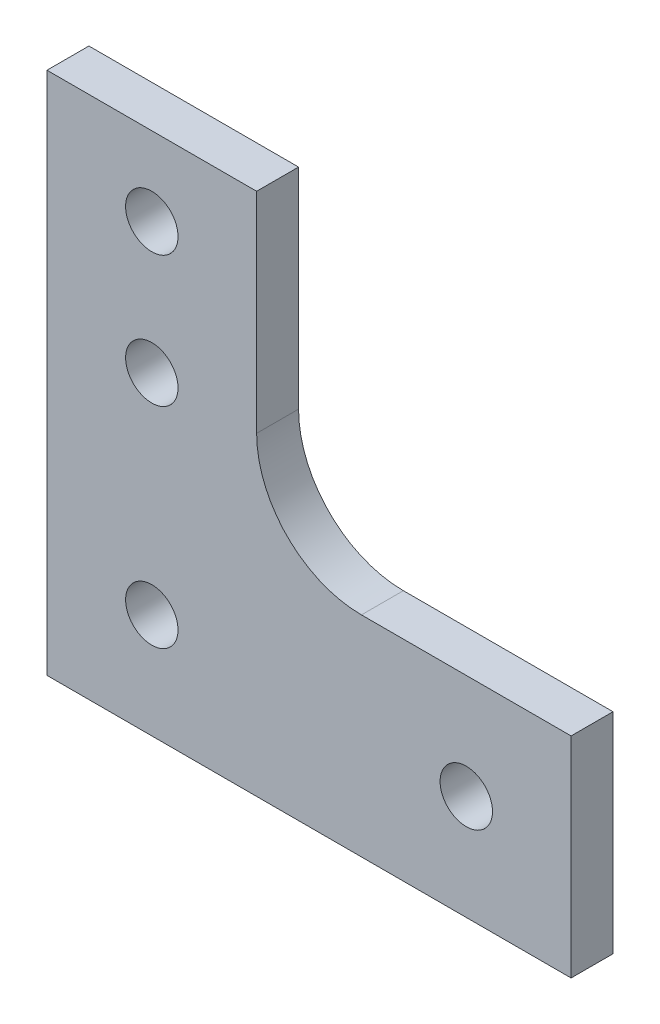
ISO-10303-21;
HEADER;
FILE_DESCRIPTION(('STEP AP214'),'2;1');
FILE_NAME('part.step','',(''),(''),'','','');
FILE_SCHEMA(('AUTOMOTIVE_DESIGN { 1 0 10303 214 1 1 1 1 }'));
ENDSEC;
DATA;
#1=APPLICATION_CONTEXT('core data for automotive mechanical design processes');
#2=APPLICATION_PROTOCOL_DEFINITION('international standard','automotive_design',2000,#1);
#3=PRODUCT_CONTEXT('',#1,'mechanical');
#4=PRODUCT('Part','Part','',(#3));
#5=PRODUCT_RELATED_PRODUCT_CATEGORY('part','',(#4));
#6=PRODUCT_DEFINITION_FORMATION('','',#4);
#7=PRODUCT_DEFINITION_CONTEXT('part definition',#1,'design');
#8=PRODUCT_DEFINITION('design','',#6,#7);
#9=PRODUCT_DEFINITION_SHAPE('','',#8);
#10=(LENGTH_UNIT() NAMED_UNIT(*) SI_UNIT(.MILLI.,.METRE.));
#11=(NAMED_UNIT(*) PLANE_ANGLE_UNIT() SI_UNIT($,.RADIAN.));
#12=(NAMED_UNIT(*) SI_UNIT($,.STERADIAN.) SOLID_ANGLE_UNIT());
#13=UNCERTAINTY_MEASURE_WITH_UNIT(LENGTH_MEASURE(1.E-05),#10,'distance_accuracy_value','');
#14=(GEOMETRIC_REPRESENTATION_CONTEXT(3) GLOBAL_UNCERTAINTY_ASSIGNED_CONTEXT((#13)) GLOBAL_UNIT_ASSIGNED_CONTEXT((#10,
#11,#12)) REPRESENTATION_CONTEXT('',''));
#15=CARTESIAN_POINT('',(0.,0.,0.));
#16=DIRECTION('',(0.,0.,1.));
#17=DIRECTION('',(1.,0.,0.));
#18=AXIS2_PLACEMENT_3D('',#15,#16,#17);
#19=CARTESIAN_POINT('',(0.,0.,4.));
#20=DIRECTION('',(0.,0.,1.));
#21=DIRECTION('',(1.,0.,0.));
#22=AXIS2_PLACEMENT_3D('',#19,#20,#21);
#23=PLANE('',#22);
#24=CARTESIAN_POINT('',(20.,0.,4.));
#25=DIRECTION('',(0.,0.,1.));
#26=DIRECTION('',(1.,0.,0.));
#27=AXIS2_PLACEMENT_3D('',#24,#25,#26);
#28=CIRCLE('',#27,2.49999999999992);
#29=CARTESIAN_POINT('',(22.4999999999999,0.,4.));
#30=VERTEX_POINT('',#29);
#31=EDGE_CURVE('E180',#30,#30,#28,.T.);
#32=ORIENTED_EDGE('',*,*,#31,.F.);
#33=EDGE_LOOP('',(#32));
#34=FACE_BOUND('',#33,.T.);
#35=CARTESIAN_POINT('',(-9.99999999999949,32.5,4.));
#36=DIRECTION('',(0.,0.,1.));
#37=DIRECTION('',(1.,0.,0.));
#38=AXIS2_PLACEMENT_3D('',#35,#36,#37);
#39=CIRCLE('',#38,2.49999999999992);
#40=CARTESIAN_POINT('',(-7.49999999999957,32.5,4.));
#41=VERTEX_POINT('',#40);
#42=EDGE_CURVE('E132',#41,#41,#39,.T.);
#43=ORIENTED_EDGE('',*,*,#42,.F.);
#44=EDGE_LOOP('',(#43));
#45=FACE_BOUND('',#44,.T.);
#46=DIRECTION('',(-1.,0.,0.));
#47=VECTOR('',#46,1.);
#48=CARTESIAN_POINT('',(0.,9.99999999999995,4.));
#49=LINE('',#48,#47);
#50=CARTESIAN_POINT('',(30.,9.99999999999995,4.));
#51=VERTEX_POINT('',#50);
#52=CARTESIAN_POINT('',(9.99999999999999,9.99999999999995,4.));
#53=VERTEX_POINT('',#52);
#54=EDGE_CURVE('E105',#51,#53,#49,.T.);
#55=ORIENTED_EDGE('',*,*,#54,.T.);
#56=CARTESIAN_POINT('',(9.99999999999999,20.,4.));
#57=DIRECTION('',(0.,0.,1.));
#58=DIRECTION('',(1.,0.,0.));
#59=AXIS2_PLACEMENT_3D('',#56,#57,#58);
#60=CIRCLE('',#59,10.);
#61=CARTESIAN_POINT('',(0.,19.9999999999999,4.));
#62=VERTEX_POINT('',#61);
#63=EDGE_CURVE('E11',#53,#62,#60,.F.);
#64=ORIENTED_EDGE('',*,*,#63,.T.);
#65=DIRECTION('',(0.,1.,0.));
#66=VECTOR('',#65,1.);
#67=CARTESIAN_POINT('',(0.,20.,4.));
#68=LINE('',#67,#66);
#69=CARTESIAN_POINT('',(0.,40.,4.));
#70=VERTEX_POINT('',#69);
#71=EDGE_CURVE('E95',#62,#70,#68,.T.);
#72=ORIENTED_EDGE('',*,*,#71,.T.);
#73=DIRECTION('',(-1.,0.,0.));
#74=VECTOR('',#73,1.);
#75=CARTESIAN_POINT('',(-19.9999999999999,40.,4.));
#76=LINE('',#75,#74);
#77=CARTESIAN_POINT('',(-19.9999999999999,40.,4.));
#78=VERTEX_POINT('',#77);
#79=EDGE_CURVE('E99',#70,#78,#76,.T.);
#80=ORIENTED_EDGE('',*,*,#79,.T.);
#81=DIRECTION('',(0.,-1.,0.));
#82=VECTOR('',#81,1.);
#83=CARTESIAN_POINT('',(-19.9999999999999,-10.,4.));
#84=LINE('',#83,#82);
#85=CARTESIAN_POINT('',(-19.9999999999999,-10.,4.));
#86=VERTEX_POINT('',#85);
#87=EDGE_CURVE('E119',#78,#86,#84,.T.);
#88=ORIENTED_EDGE('',*,*,#87,.T.);
#89=DIRECTION('',(1.,0.,0.));
#90=VECTOR('',#89,1.);
#91=CARTESIAN_POINT('',(30.,-10.,4.));
#92=LINE('',#91,#90);
#93=CARTESIAN_POINT('',(30.,-10.,4.));
#94=VERTEX_POINT('',#93);
#95=EDGE_CURVE('E121',#86,#94,#92,.T.);
#96=ORIENTED_EDGE('',*,*,#95,.T.);
#97=DIRECTION('',(0.,1.,0.));
#98=VECTOR('',#97,1.);
#99=CARTESIAN_POINT('',(30.,-10.,4.));
#100=LINE('',#99,#98);
#101=EDGE_CURVE('E126',#94,#51,#100,.T.);
#102=ORIENTED_EDGE('',*,*,#101,.T.);
#103=EDGE_LOOP('',(#55,#64,#72,#80,#88,#96,#102));
#104=FACE_BOUND('',#103,.T.);
#105=CARTESIAN_POINT('',(-9.99999999999997,0.,4.));
#106=DIRECTION('',(0.,0.,1.));
#107=DIRECTION('',(1.,0.,0.));
#108=AXIS2_PLACEMENT_3D('',#105,#106,#107);
#109=CIRCLE('',#108,2.49999999999992);
#110=CARTESIAN_POINT('',(-7.50000000000005,0.,4.));
#111=VERTEX_POINT('',#110);
#112=EDGE_CURVE('E174',#111,#111,#109,.T.);
#113=ORIENTED_EDGE('',*,*,#112,.F.);
#114=EDGE_LOOP('',(#113));
#115=FACE_BOUND('',#114,.T.);
#116=CARTESIAN_POINT('',(-9.9999999999996,20.,4.));
#117=DIRECTION('',(0.,0.,1.));
#118=DIRECTION('',(1.,0.,0.));
#119=AXIS2_PLACEMENT_3D('',#116,#117,#118);
#120=CIRCLE('',#119,2.49999999999992);
#121=CARTESIAN_POINT('',(-7.49999999999968,20.,4.));
#122=VERTEX_POINT('',#121);
#123=EDGE_CURVE('E186',#122,#122,#120,.T.);
#124=ORIENTED_EDGE('',*,*,#123,.F.);
#125=EDGE_LOOP('',(#124));
#126=FACE_BOUND('',#125,.T.);
#127=ADVANCED_FACE('F38',(#34,#45,#104,#115,#126),#23,.T.);
#128=CARTESIAN_POINT('',(0.,0.,0.));
#129=DIRECTION('',(0.,0.,1.));
#130=DIRECTION('',(1.,0.,0.));
#131=AXIS2_PLACEMENT_3D('',#128,#129,#130);
#132=PLANE('',#131);
#133=DIRECTION('',(0.,1.,0.));
#134=VECTOR('',#133,1.);
#135=CARTESIAN_POINT('',(0.,40.,0.));
#136=LINE('',#135,#134);
#137=CARTESIAN_POINT('',(0.,19.9999999999999,0.));
#138=VERTEX_POINT('',#137);
#139=CARTESIAN_POINT('',(0.,40.,0.));
#140=VERTEX_POINT('',#139);
#141=EDGE_CURVE('E110',#138,#140,#136,.T.);
#142=ORIENTED_EDGE('',*,*,#141,.F.);
#143=CARTESIAN_POINT('',(9.99999999999999,20.,0.));
#144=DIRECTION('',(0.,0.,1.));
#145=DIRECTION('',(1.,0.,0.));
#146=AXIS2_PLACEMENT_3D('',#143,#144,#145);
#147=CIRCLE('',#146,10.);
#148=CARTESIAN_POINT('',(9.99999999999999,9.99999999999995,0.));
#149=VERTEX_POINT('',#148);
#150=EDGE_CURVE('E46',#138,#149,#147,.T.);
#151=ORIENTED_EDGE('',*,*,#150,.T.);
#152=DIRECTION('',(-1.,0.,0.));
#153=VECTOR('',#152,1.);
#154=CARTESIAN_POINT('',(30.,9.99999999999995,0.));
#155=LINE('',#154,#153);
#156=CARTESIAN_POINT('',(30.,9.99999999999995,0.));
#157=VERTEX_POINT('',#156);
#158=EDGE_CURVE('E140',#157,#149,#155,.T.);
#159=ORIENTED_EDGE('',*,*,#158,.F.);
#160=DIRECTION('',(0.,1.,0.));
#161=VECTOR('',#160,1.);
#162=CARTESIAN_POINT('',(30.,-10.,0.));
#163=LINE('',#162,#161);
#164=CARTESIAN_POINT('',(30.,-10.,0.));
#165=VERTEX_POINT('',#164);
#166=EDGE_CURVE('E138',#165,#157,#163,.T.);
#167=ORIENTED_EDGE('',*,*,#166,.F.);
#168=DIRECTION('',(1.,0.,0.));
#169=VECTOR('',#168,1.);
#170=CARTESIAN_POINT('',(30.,-10.,0.));
#171=LINE('',#170,#169);
#172=CARTESIAN_POINT('',(-19.9999999999999,-10.,0.));
#173=VERTEX_POINT('',#172);
#174=EDGE_CURVE('E136',#173,#165,#171,.T.);
#175=ORIENTED_EDGE('',*,*,#174,.F.);
#176=DIRECTION('',(0.,-1.,0.));
#177=VECTOR('',#176,1.);
#178=CARTESIAN_POINT('',(-19.9999999999999,-10.,0.));
#179=LINE('',#178,#177);
#180=CARTESIAN_POINT('',(-19.9999999999999,40.,0.));
#181=VERTEX_POINT('',#180);
#182=EDGE_CURVE('E134',#181,#173,#179,.T.);
#183=ORIENTED_EDGE('',*,*,#182,.F.);
#184=DIRECTION('',(-1.,0.,0.));
#185=VECTOR('',#184,1.);
#186=CARTESIAN_POINT('',(-19.9999999999999,40.,0.));
#187=LINE('',#186,#185);
#188=EDGE_CURVE('E131',#140,#181,#187,.T.);
#189=ORIENTED_EDGE('',*,*,#188,.F.);
#190=EDGE_LOOP('',(#142,#151,#159,#167,#175,#183,#189));
#191=FACE_BOUND('',#190,.T.);
#192=CARTESIAN_POINT('',(-9.99999999999949,32.5,0.));
#193=DIRECTION('',(0.,0.,1.));
#194=DIRECTION('',(1.,0.,0.));
#195=AXIS2_PLACEMENT_3D('',#192,#193,#194);
#196=CIRCLE('',#195,2.49999999999992);
#197=CARTESIAN_POINT('',(-7.49999999999957,32.5,0.));
#198=VERTEX_POINT('',#197);
#199=EDGE_CURVE('E171',#198,#198,#196,.T.);
#200=ORIENTED_EDGE('',*,*,#199,.T.);
#201=EDGE_LOOP('',(#200));
#202=FACE_BOUND('',#201,.T.);
#203=CARTESIAN_POINT('',(-9.99999999999997,0.,0.));
#204=DIRECTION('',(0.,0.,1.));
#205=DIRECTION('',(1.,0.,0.));
#206=AXIS2_PLACEMENT_3D('',#203,#204,#205);
#207=CIRCLE('',#206,2.49999999999992);
#208=CARTESIAN_POINT('',(-7.50000000000005,0.,0.));
#209=VERTEX_POINT('',#208);
#210=EDGE_CURVE('E177',#209,#209,#207,.T.);
#211=ORIENTED_EDGE('',*,*,#210,.T.);
#212=EDGE_LOOP('',(#211));
#213=FACE_BOUND('',#212,.T.);
#214=CARTESIAN_POINT('',(20.,0.,0.));
#215=DIRECTION('',(0.,0.,1.));
#216=DIRECTION('',(1.,0.,0.));
#217=AXIS2_PLACEMENT_3D('',#214,#215,#216);
#218=CIRCLE('',#217,2.49999999999992);
#219=CARTESIAN_POINT('',(22.4999999999999,0.,0.));
#220=VERTEX_POINT('',#219);
#221=EDGE_CURVE('E183',#220,#220,#218,.T.);
#222=ORIENTED_EDGE('',*,*,#221,.T.);
#223=EDGE_LOOP('',(#222));
#224=FACE_BOUND('',#223,.T.);
#225=CARTESIAN_POINT('',(-9.9999999999996,20.,0.));
#226=DIRECTION('',(0.,0.,1.));
#227=DIRECTION('',(1.,0.,0.));
#228=AXIS2_PLACEMENT_3D('',#225,#226,#227);
#229=CIRCLE('',#228,2.49999999999992);
#230=CARTESIAN_POINT('',(-7.49999999999968,20.,0.));
#231=VERTEX_POINT('',#230);
#232=EDGE_CURVE('E189',#231,#231,#229,.T.);
#233=ORIENTED_EDGE('',*,*,#232,.T.);
#234=EDGE_LOOP('',(#233));
#235=FACE_BOUND('',#234,.T.);
#236=ADVANCED_FACE('F153',(#191,#202,#213,#224,#235),#132,.F.);
#237=CARTESIAN_POINT('',(0.,40.,4.));
#238=DIRECTION('',(-1.,0.,0.));
#239=DIRECTION('',(0.,-1.,0.));
#240=AXIS2_PLACEMENT_3D('',#237,#238,#239);
#241=PLANE('',#240);
#242=ORIENTED_EDGE('',*,*,#71,.F.);
#243=DIRECTION('',(0.,0.,-1.));
#244=VECTOR('',#243,1.);
#245=CARTESIAN_POINT('',(0.,19.9999999999999,0.));
#246=LINE('',#245,#244);
#247=EDGE_CURVE('E113',#62,#138,#246,.T.);
#248=ORIENTED_EDGE('',*,*,#247,.T.);
#249=ORIENTED_EDGE('',*,*,#141,.T.);
#250=DIRECTION('',(0.,0.,-1.));
#251=VECTOR('',#250,1.);
#252=CARTESIAN_POINT('',(0.,40.,4.));
#253=LINE('',#252,#251);
#254=EDGE_CURVE('E108',#70,#140,#253,.T.);
#255=ORIENTED_EDGE('',*,*,#254,.F.);
#256=EDGE_LOOP('',(#242,#248,#249,#255));
#257=FACE_BOUND('',#256,.T.);
#258=ADVANCED_FACE('F109',(#257),#241,.F.);
#259=CARTESIAN_POINT('',(-19.9999999999999,40.,4.));
#260=DIRECTION('',(0.,-1.,0.));
#261=DIRECTION('',(0.,0.,-1.));
#262=AXIS2_PLACEMENT_3D('',#259,#260,#261);
#263=PLANE('',#262);
#264=ORIENTED_EDGE('',*,*,#188,.T.);
#265=DIRECTION('',(0.,0.,-1.));
#266=VECTOR('',#265,1.);
#267=CARTESIAN_POINT('',(-19.9999999999999,40.,4.));
#268=LINE('',#267,#266);
#269=EDGE_CURVE('E114',#78,#181,#268,.T.);
#270=ORIENTED_EDGE('',*,*,#269,.F.);
#271=ORIENTED_EDGE('',*,*,#79,.F.);
#272=ORIENTED_EDGE('',*,*,#254,.T.);
#273=EDGE_LOOP('',(#264,#270,#271,#272));
#274=FACE_BOUND('',#273,.T.);
#275=ADVANCED_FACE('F116',(#274),#263,.F.);
#276=CARTESIAN_POINT('',(-19.9999999999999,-10.,4.));
#277=DIRECTION('',(1.,0.,0.));
#278=DIRECTION('',(0.,1.,0.));
#279=AXIS2_PLACEMENT_3D('',#276,#277,#278);
#280=PLANE('',#279);
#281=ORIENTED_EDGE('',*,*,#182,.T.);
#282=DIRECTION('',(0.,0.,-1.));
#283=VECTOR('',#282,1.);
#284=CARTESIAN_POINT('',(-19.9999999999999,-10.,4.));
#285=LINE('',#284,#283);
#286=EDGE_CURVE('E147',#86,#173,#285,.T.);
#287=ORIENTED_EDGE('',*,*,#286,.F.);
#288=ORIENTED_EDGE('',*,*,#87,.F.);
#289=ORIENTED_EDGE('',*,*,#269,.T.);
#290=EDGE_LOOP('',(#281,#287,#288,#289));
#291=FACE_BOUND('',#290,.T.);
#292=ADVANCED_FACE('F158',(#291),#280,.F.);
#293=CARTESIAN_POINT('',(30.,-10.,4.));
#294=DIRECTION('',(0.,1.,0.));
#295=DIRECTION('',(0.,0.,1.));
#296=AXIS2_PLACEMENT_3D('',#293,#294,#295);
#297=PLANE('',#296);
#298=ORIENTED_EDGE('',*,*,#174,.T.);
#299=DIRECTION('',(0.,0.,-1.));
#300=VECTOR('',#299,1.);
#301=CARTESIAN_POINT('',(30.,-10.,4.));
#302=LINE('',#301,#300);
#303=EDGE_CURVE('E144',#94,#165,#302,.T.);
#304=ORIENTED_EDGE('',*,*,#303,.F.);
#305=ORIENTED_EDGE('',*,*,#95,.F.);
#306=ORIENTED_EDGE('',*,*,#286,.T.);
#307=EDGE_LOOP('',(#298,#304,#305,#306));
#308=FACE_BOUND('',#307,.T.);
#309=ADVANCED_FACE('F165',(#308),#297,.F.);
#310=CARTESIAN_POINT('',(30.,-10.,4.));
#311=DIRECTION('',(-1.,0.,0.));
#312=DIRECTION('',(0.,0.,1.));
#313=AXIS2_PLACEMENT_3D('',#310,#311,#312);
#314=PLANE('',#313);
#315=ORIENTED_EDGE('',*,*,#166,.T.);
#316=DIRECTION('',(0.,0.,-1.));
#317=VECTOR('',#316,1.);
#318=CARTESIAN_POINT('',(30.,9.99999999999995,4.));
#319=LINE('',#318,#317);
#320=EDGE_CURVE('E129',#51,#157,#319,.T.);
#321=ORIENTED_EDGE('',*,*,#320,.F.);
#322=ORIENTED_EDGE('',*,*,#101,.F.);
#323=ORIENTED_EDGE('',*,*,#303,.T.);
#324=EDGE_LOOP('',(#315,#321,#322,#323));
#325=FACE_BOUND('',#324,.T.);
#326=ADVANCED_FACE('F168',(#325),#314,.F.);
#327=CARTESIAN_POINT('',(30.,9.99999999999995,4.));
#328=DIRECTION('',(0.,-1.,0.));
#329=DIRECTION('',(0.,0.,-1.));
#330=AXIS2_PLACEMENT_3D('',#327,#328,#329);
#331=PLANE('',#330);
#332=ORIENTED_EDGE('',*,*,#158,.T.);
#333=DIRECTION('',(0.,0.,-1.));
#334=VECTOR('',#333,1.);
#335=CARTESIAN_POINT('',(9.99999999999999,9.99999999999995,4.));
#336=LINE('',#335,#334);
#337=EDGE_CURVE('E53',#149,#53,#336,.F.);
#338=ORIENTED_EDGE('',*,*,#337,.T.);
#339=ORIENTED_EDGE('',*,*,#54,.F.);
#340=ORIENTED_EDGE('',*,*,#320,.T.);
#341=EDGE_LOOP('',(#332,#338,#339,#340));
#342=FACE_BOUND('',#341,.T.);
#343=ADVANCED_FACE('F169',(#342),#331,.F.);
#344=CARTESIAN_POINT('',(-9.99999999999949,32.5,4.));
#345=DIRECTION('',(0.,0.,-1.));
#346=DIRECTION('',(-1.,0.,0.));
#347=AXIS2_PLACEMENT_3D('',#344,#345,#346);
#348=CYLINDRICAL_SURFACE('',#347,2.49999999999992);
#349=ORIENTED_EDGE('',*,*,#42,.T.);
#350=EDGE_LOOP('',(#349));
#351=FACE_BOUND('',#350,.T.);
#352=ORIENTED_EDGE('',*,*,#199,.F.);
#353=EDGE_LOOP('',(#352));
#354=FACE_BOUND('',#353,.T.);
#355=ADVANCED_FACE('F208',(#351,#354),#348,.F.);
#356=CARTESIAN_POINT('',(-9.99999999999997,0.,4.));
#357=DIRECTION('',(0.,0.,-1.));
#358=DIRECTION('',(-1.,0.,0.));
#359=AXIS2_PLACEMENT_3D('',#356,#357,#358);
#360=CYLINDRICAL_SURFACE('',#359,2.49999999999992);
#361=ORIENTED_EDGE('',*,*,#112,.T.);
#362=EDGE_LOOP('',(#361));
#363=FACE_BOUND('',#362,.T.);
#364=ORIENTED_EDGE('',*,*,#210,.F.);
#365=EDGE_LOOP('',(#364));
#366=FACE_BOUND('',#365,.T.);
#367=ADVANCED_FACE('F252',(#363,#366),#360,.F.);
#368=CARTESIAN_POINT('',(20.,0.,4.));
#369=DIRECTION('',(0.,0.,-1.));
#370=DIRECTION('',(-1.,0.,0.));
#371=AXIS2_PLACEMENT_3D('',#368,#369,#370);
#372=CYLINDRICAL_SURFACE('',#371,2.49999999999992);
#373=ORIENTED_EDGE('',*,*,#31,.T.);
#374=EDGE_LOOP('',(#373));
#375=FACE_BOUND('',#374,.T.);
#376=ORIENTED_EDGE('',*,*,#221,.F.);
#377=EDGE_LOOP('',(#376));
#378=FACE_BOUND('',#377,.T.);
#379=ADVANCED_FACE('F259',(#375,#378),#372,.F.);
#380=CARTESIAN_POINT('',(-9.9999999999996,20.,4.));
#381=DIRECTION('',(0.,0.,-1.));
#382=DIRECTION('',(-1.,0.,0.));
#383=AXIS2_PLACEMENT_3D('',#380,#381,#382);
#384=CYLINDRICAL_SURFACE('',#383,2.49999999999992);
#385=ORIENTED_EDGE('',*,*,#123,.T.);
#386=EDGE_LOOP('',(#385));
#387=FACE_BOUND('',#386,.T.);
#388=ORIENTED_EDGE('',*,*,#232,.F.);
#389=EDGE_LOOP('',(#388));
#390=FACE_BOUND('',#389,.T.);
#391=ADVANCED_FACE('F195',(#387,#390),#384,.F.);
#392=CARTESIAN_POINT('',(9.99999999999999,20.,4.));
#393=DIRECTION('',(0.,0.,1.));
#394=DIRECTION('',(1.,0.,0.));
#395=AXIS2_PLACEMENT_3D('',#392,#393,#394);
#396=CYLINDRICAL_SURFACE('',#395,10.);
#397=ORIENTED_EDGE('',*,*,#63,.F.);
#398=ORIENTED_EDGE('',*,*,#337,.F.);
#399=ORIENTED_EDGE('',*,*,#150,.F.);
#400=ORIENTED_EDGE('',*,*,#247,.F.);
#401=EDGE_LOOP('',(#397,#398,#399,#400));
#402=FACE_BOUND('',#401,.T.);
#403=ADVANCED_FACE('F40',(#402),#396,.F.);
#404=CLOSED_SHELL('',(#127,#236,#258,#275,#292,#309,#326,#343,#355,#367,#379,#391,#403));
#405=MANIFOLD_SOLID_BREP('B2',#404);
#406=ADVANCED_BREP_SHAPE_REPRESENTATION('',(#18,#405),#14);
#407=SHAPE_DEFINITION_REPRESENTATION(#9,#406);
ENDSEC;
END-ISO-10303-21;
